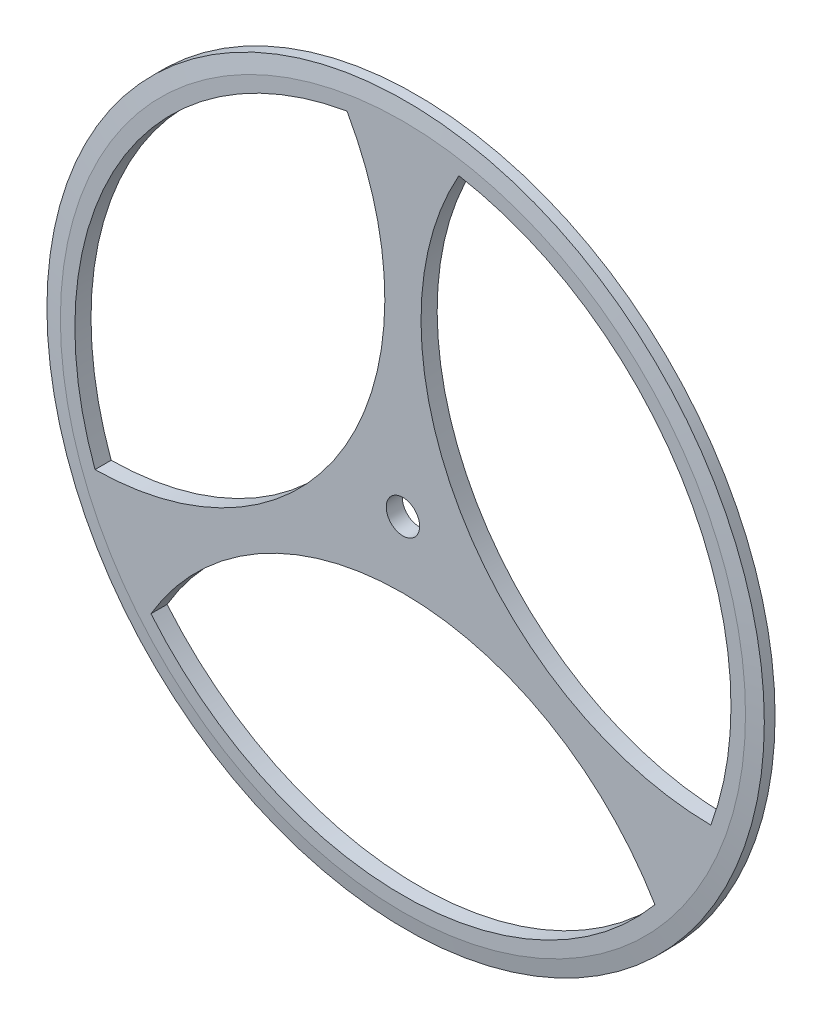
ISO-10303-21;
HEADER;
FILE_DESCRIPTION(('STEP AP214'),'2;1');
FILE_NAME('part.step','',(''),(''),'','','');
FILE_SCHEMA(('AUTOMOTIVE_DESIGN { 1 0 10303 214 1 1 1 1 }'));
ENDSEC;
DATA;
#1=APPLICATION_CONTEXT('core data for automotive mechanical design processes');
#2=APPLICATION_PROTOCOL_DEFINITION('international standard','automotive_design',2000,#1);
#3=PRODUCT_CONTEXT('',#1,'mechanical');
#4=PRODUCT('Part','Part','',(#3));
#5=PRODUCT_RELATED_PRODUCT_CATEGORY('part','',(#4));
#6=PRODUCT_DEFINITION_FORMATION('','',#4);
#7=PRODUCT_DEFINITION_CONTEXT('part definition',#1,'design');
#8=PRODUCT_DEFINITION('design','',#6,#7);
#9=PRODUCT_DEFINITION_SHAPE('','',#8);
#10=(LENGTH_UNIT() NAMED_UNIT(*) SI_UNIT(.MILLI.,.METRE.));
#11=(NAMED_UNIT(*) PLANE_ANGLE_UNIT() SI_UNIT($,.RADIAN.));
#12=(NAMED_UNIT(*) SI_UNIT($,.STERADIAN.) SOLID_ANGLE_UNIT());
#13=UNCERTAINTY_MEASURE_WITH_UNIT(LENGTH_MEASURE(1.E-05),#10,'distance_accuracy_value','');
#14=(GEOMETRIC_REPRESENTATION_CONTEXT(3) GLOBAL_UNCERTAINTY_ASSIGNED_CONTEXT((#13)) GLOBAL_UNIT_ASSIGNED_CONTEXT((#10,
#11,#12)) REPRESENTATION_CONTEXT('',''));
#15=CARTESIAN_POINT('',(0.,0.,0.));
#16=DIRECTION('',(0.,0.,1.));
#17=DIRECTION('',(1.,0.,0.));
#18=AXIS2_PLACEMENT_3D('',#15,#16,#17);
#19=CARTESIAN_POINT('',(0.,0.,0.15));
#20=DIRECTION('',(0.,0.,-1.));
#21=DIRECTION('',(-1.,0.,0.));
#22=AXIS2_PLACEMENT_3D('',#19,#20,#21);
#23=CYLINDRICAL_SURFACE('',#22,6.67);
#24=CARTESIAN_POINT('',(0.,0.,0.100000000000001));
#25=DIRECTION('',(0.,0.,1.));
#26=DIRECTION('',(1.,0.,0.));
#27=AXIS2_PLACEMENT_3D('',#24,#25,#26);
#28=CIRCLE('',#27,6.67);
#29=CARTESIAN_POINT('',(6.67,0.,0.100000000000001));
#30=VERTEX_POINT('',#29);
#31=EDGE_CURVE('E11',#30,#30,#28,.F.);
#32=ORIENTED_EDGE('',*,*,#31,.T.);
#33=EDGE_LOOP('',(#32));
#34=FACE_BOUND('',#33,.T.);
#35=CARTESIAN_POINT('',(0.,0.,-0.100000000000001));
#36=DIRECTION('',(0.,0.,1.));
#37=DIRECTION('',(1.,0.,0.));
#38=AXIS2_PLACEMENT_3D('',#35,#36,#37);
#39=CIRCLE('',#38,6.67);
#40=CARTESIAN_POINT('',(6.67,0.,-0.100000000000001));
#41=VERTEX_POINT('',#40);
#42=EDGE_CURVE('E145',#41,#41,#39,.T.);
#43=ORIENTED_EDGE('',*,*,#42,.T.);
#44=EDGE_LOOP('',(#43));
#45=FACE_BOUND('',#44,.T.);
#46=ADVANCED_FACE('F37',(#34,#45),#23,.T.);
#47=CARTESIAN_POINT('',(0.,0.,0.15));
#48=DIRECTION('',(0.,0.,1.));
#49=DIRECTION('',(1.,0.,0.));
#50=AXIS2_PLACEMENT_3D('',#47,#48,#49);
#51=PLANE('',#50);
#52=CARTESIAN_POINT('',(0.,0.,0.15));
#53=DIRECTION('',(0.,0.,1.));
#54=DIRECTION('',(-0.499999999999992,-0.866025403784443,0.));
#55=AXIS2_PLACEMENT_3D('',#52,#53,#54);
#56=CIRCLE('',#55,6.10000000000001);
#57=CARTESIAN_POINT('',(-4.68546660923413,-3.90594452773618,0.15));
#58=VERTEX_POINT('',#57);
#59=CARTESIAN_POINT('',(4.68546660923418,-3.90594452773611,0.15));
#60=VERTEX_POINT('',#59);
#61=EDGE_CURVE('E52',#58,#60,#56,.T.);
#62=ORIENTED_EDGE('',*,*,#61,.F.);
#63=CARTESIAN_POINT('',(0.,-6.67,0.15));
#64=DIRECTION('',(0.,0.,1.));
#65=DIRECTION('',(-0.499999999999992,-0.866025403784443,0.));
#66=AXIS2_PLACEMENT_3D('',#63,#64,#65);
#67=CIRCLE('',#66,5.44);
#68=EDGE_CURVE('E96',#60,#58,#67,.T.);
#69=ORIENTED_EDGE('',*,*,#68,.F.);
#70=EDGE_LOOP('',(#62,#69));
#71=FACE_BOUND('',#70,.T.);
#72=CARTESIAN_POINT('',(0.,0.,0.15));
#73=DIRECTION('',(0.,0.,1.));
#74=DIRECTION('',(-0.500000000000004,0.866025403784436,0.));
#75=AXIS2_PLACEMENT_3D('',#72,#73,#74);
#76=CIRCLE('',#75,6.10000000000001);
#77=CARTESIAN_POINT('',(-1.03991388217525,6.01070537604859,0.15));
#78=VERTEX_POINT('',#77);
#79=CARTESIAN_POINT('',(-5.72538049140939,-2.10476084831246,0.15));
#80=VERTEX_POINT('',#79);
#81=EDGE_CURVE('E92',#78,#80,#76,.T.);
#82=ORIENTED_EDGE('',*,*,#81,.F.);
#83=CARTESIAN_POINT('',(-5.77638944324221,3.33499999999999,0.15));
#84=DIRECTION('',(0.,0.,1.));
#85=DIRECTION('',(-0.500000000000004,0.866025403784436,0.));
#86=AXIS2_PLACEMENT_3D('',#83,#84,#85);
#87=CIRCLE('',#86,5.44);
#88=EDGE_CURVE('E109',#80,#78,#87,.T.);
#89=ORIENTED_EDGE('',*,*,#88,.F.);
#90=EDGE_LOOP('',(#82,#89));
#91=FACE_BOUND('',#90,.T.);
#92=CARTESIAN_POINT('',(0.,0.,0.15));
#93=DIRECTION('',(0.,0.,1.));
#94=DIRECTION('',(1.,0.,0.));
#95=AXIS2_PLACEMENT_3D('',#92,#93,#94);
#96=CIRCLE('',#95,6.10000000000001);
#97=CARTESIAN_POINT('',(5.72538049140938,-2.10476084831246,0.15));
#98=VERTEX_POINT('',#97);
#99=CARTESIAN_POINT('',(1.03991388217525,6.01070537604858,0.15));
#100=VERTEX_POINT('',#99);
#101=EDGE_CURVE('E121',#98,#100,#96,.T.);
#102=ORIENTED_EDGE('',*,*,#101,.F.);
#103=CARTESIAN_POINT('',(5.77638944324221,3.33499999999999,0.15));
#104=DIRECTION('',(0.,0.,1.));
#105=DIRECTION('',(1.,0.,0.));
#106=AXIS2_PLACEMENT_3D('',#103,#104,#105);
#107=CIRCLE('',#106,5.44);
#108=EDGE_CURVE('E125',#100,#98,#107,.T.);
#109=ORIENTED_EDGE('',*,*,#108,.F.);
#110=EDGE_LOOP('',(#102,#109));
#111=FACE_BOUND('',#110,.T.);
#112=CARTESIAN_POINT('',(0.,0.,0.15));
#113=DIRECTION('',(0.,0.,1.));
#114=DIRECTION('',(1.,0.,0.));
#115=AXIS2_PLACEMENT_3D('',#112,#113,#114);
#116=CIRCLE('',#115,0.3105);
#117=CARTESIAN_POINT('',(0.3105,0.,0.15));
#118=VERTEX_POINT('',#117);
#119=EDGE_CURVE('E137',#118,#118,#116,.T.);
#120=ORIENTED_EDGE('',*,*,#119,.F.);
#121=EDGE_LOOP('',(#120));
#122=FACE_BOUND('',#121,.T.);
#123=CARTESIAN_POINT('',(0.,0.,0.15));
#124=DIRECTION('',(0.,0.,1.));
#125=DIRECTION('',(1.,0.,0.));
#126=AXIS2_PLACEMENT_3D('',#123,#124,#125);
#127=CIRCLE('',#126,6.36999999999999);
#128=CARTESIAN_POINT('',(6.36999999999999,0.,0.15));
#129=VERTEX_POINT('',#128);
#130=EDGE_CURVE('E45',#129,#129,#127,.T.);
#131=ORIENTED_EDGE('',*,*,#130,.T.);
#132=EDGE_LOOP('',(#131));
#133=FACE_BOUND('',#132,.T.);
#134=ADVANCED_FACE('F100',(#71,#91,#111,#122,#133),#51,.T.);
#135=CARTESIAN_POINT('',(0.,0.,-0.15));
#136=DIRECTION('',(0.,0.,1.));
#137=DIRECTION('',(1.,0.,0.));
#138=AXIS2_PLACEMENT_3D('',#135,#136,#137);
#139=PLANE('',#138);
#140=CARTESIAN_POINT('',(0.,-6.67,-0.15));
#141=DIRECTION('',(0.,0.,1.));
#142=DIRECTION('',(-0.499999999999992,-0.866025403784443,0.));
#143=AXIS2_PLACEMENT_3D('',#140,#141,#142);
#144=CIRCLE('',#143,5.44);
#145=CARTESIAN_POINT('',(4.68546660923418,-3.90594452773611,-0.15));
#146=VERTEX_POINT('',#145);
#147=CARTESIAN_POINT('',(-4.68546660923413,-3.90594452773617,-0.15));
#148=VERTEX_POINT('',#147);
#149=EDGE_CURVE('E105',#146,#148,#144,.T.);
#150=ORIENTED_EDGE('',*,*,#149,.T.);
#151=CARTESIAN_POINT('',(0.,0.,-0.15));
#152=DIRECTION('',(0.,0.,1.));
#153=DIRECTION('',(-0.499999999999992,-0.866025403784443,0.));
#154=AXIS2_PLACEMENT_3D('',#151,#152,#153);
#155=CIRCLE('',#154,6.10000000000001);
#156=EDGE_CURVE('E57',#148,#146,#155,.T.);
#157=ORIENTED_EDGE('',*,*,#156,.T.);
#158=EDGE_LOOP('',(#150,#157));
#159=FACE_BOUND('',#158,.T.);
#160=CARTESIAN_POINT('',(-5.77638944324221,3.33499999999999,-0.15));
#161=DIRECTION('',(0.,0.,1.));
#162=DIRECTION('',(-0.500000000000004,0.866025403784436,0.));
#163=AXIS2_PLACEMENT_3D('',#160,#161,#162);
#164=CIRCLE('',#163,5.44);
#165=CARTESIAN_POINT('',(-5.72538049140939,-2.10476084831246,-0.15));
#166=VERTEX_POINT('',#165);
#167=CARTESIAN_POINT('',(-1.03991388217525,6.01070537604859,-0.15));
#168=VERTEX_POINT('',#167);
#169=EDGE_CURVE('E115',#166,#168,#164,.T.);
#170=ORIENTED_EDGE('',*,*,#169,.T.);
#171=CARTESIAN_POINT('',(0.,0.,-0.15));
#172=DIRECTION('',(0.,0.,1.));
#173=DIRECTION('',(-0.500000000000004,0.866025403784436,0.));
#174=AXIS2_PLACEMENT_3D('',#171,#172,#173);
#175=CIRCLE('',#174,6.10000000000001);
#176=EDGE_CURVE('E112',#168,#166,#175,.T.);
#177=ORIENTED_EDGE('',*,*,#176,.T.);
#178=EDGE_LOOP('',(#170,#177));
#179=FACE_BOUND('',#178,.T.);
#180=CARTESIAN_POINT('',(5.77638944324221,3.33499999999999,-0.15));
#181=DIRECTION('',(0.,0.,1.));
#182=DIRECTION('',(1.,0.,0.));
#183=AXIS2_PLACEMENT_3D('',#180,#181,#182);
#184=CIRCLE('',#183,5.44);
#185=CARTESIAN_POINT('',(1.03991388217525,6.01070537604858,-0.15));
#186=VERTEX_POINT('',#185);
#187=CARTESIAN_POINT('',(5.72538049140938,-2.10476084831246,-0.15));
#188=VERTEX_POINT('',#187);
#189=EDGE_CURVE('E131',#186,#188,#184,.T.);
#190=ORIENTED_EDGE('',*,*,#189,.T.);
#191=CARTESIAN_POINT('',(0.,0.,-0.15));
#192=DIRECTION('',(0.,0.,1.));
#193=DIRECTION('',(1.,0.,0.));
#194=AXIS2_PLACEMENT_3D('',#191,#192,#193);
#195=CIRCLE('',#194,6.10000000000001);
#196=EDGE_CURVE('E128',#188,#186,#195,.T.);
#197=ORIENTED_EDGE('',*,*,#196,.T.);
#198=EDGE_LOOP('',(#190,#197));
#199=FACE_BOUND('',#198,.T.);
#200=CARTESIAN_POINT('',(0.,0.,-0.15));
#201=DIRECTION('',(0.,0.,1.));
#202=DIRECTION('',(1.,0.,0.));
#203=AXIS2_PLACEMENT_3D('',#200,#201,#202);
#204=CIRCLE('',#203,0.3105);
#205=CARTESIAN_POINT('',(0.3105,0.,-0.15));
#206=VERTEX_POINT('',#205);
#207=EDGE_CURVE('E142',#206,#206,#204,.T.);
#208=ORIENTED_EDGE('',*,*,#207,.T.);
#209=EDGE_LOOP('',(#208));
#210=FACE_BOUND('',#209,.T.);
#211=CARTESIAN_POINT('',(0.,0.,-0.15));
#212=DIRECTION('',(0.,0.,1.));
#213=DIRECTION('',(1.,0.,0.));
#214=AXIS2_PLACEMENT_3D('',#211,#212,#213);
#215=CIRCLE('',#214,6.37);
#216=CARTESIAN_POINT('',(6.37,0.,-0.15));
#217=VERTEX_POINT('',#216);
#218=EDGE_CURVE('E148',#217,#217,#215,.F.);
#219=ORIENTED_EDGE('',*,*,#218,.T.);
#220=EDGE_LOOP('',(#219));
#221=FACE_BOUND('',#220,.T.);
#222=ADVANCED_FACE('F165',(#159,#179,#199,#210,#221),#139,.F.);
#223=CARTESIAN_POINT('',(0.,0.,-0.100000000000001));
#224=DIRECTION('',(0.,0.,1.));
#225=DIRECTION('',(1.,0.,0.));
#226=AXIS2_PLACEMENT_3D('',#223,#224,#225);
#227=CONICAL_SURFACE('',#226,6.67,1.40564764938027);
#228=ORIENTED_EDGE('',*,*,#218,.F.);
#229=EDGE_LOOP('',(#228));
#230=FACE_BOUND('',#229,.T.);
#231=ORIENTED_EDGE('',*,*,#42,.F.);
#232=EDGE_LOOP('',(#231));
#233=FACE_BOUND('',#232,.T.);
#234=ADVANCED_FACE('F156',(#230,#233),#227,.T.);
#235=CARTESIAN_POINT('',(0.,0.,0.15));
#236=DIRECTION('',(0.,0.,-1.));
#237=DIRECTION('',(-1.,0.,0.));
#238=AXIS2_PLACEMENT_3D('',#235,#236,#237);
#239=CONICAL_SURFACE('',#238,6.36999999999999,1.40564764938027);
#240=ORIENTED_EDGE('',*,*,#31,.F.);
#241=EDGE_LOOP('',(#240));
#242=FACE_BOUND('',#241,.T.);
#243=ORIENTED_EDGE('',*,*,#130,.F.);
#244=EDGE_LOOP('',(#243));
#245=FACE_BOUND('',#244,.T.);
#246=ADVANCED_FACE('F39',(#242,#245),#239,.T.);
#247=CARTESIAN_POINT('',(0.,0.,-0.15));
#248=DIRECTION('',(0.,0.,1.));
#249=DIRECTION('',(1.,0.,0.));
#250=AXIS2_PLACEMENT_3D('',#247,#248,#249);
#251=CYLINDRICAL_SURFACE('',#250,0.3105);
#252=ORIENTED_EDGE('',*,*,#207,.F.);
#253=EDGE_LOOP('',(#252));
#254=FACE_BOUND('',#253,.T.);
#255=ORIENTED_EDGE('',*,*,#119,.T.);
#256=EDGE_LOOP('',(#255));
#257=FACE_BOUND('',#256,.T.);
#258=ADVANCED_FACE('F155',(#254,#257),#251,.F.);
#259=CARTESIAN_POINT('',(0.,0.,-0.15));
#260=DIRECTION('',(0.,0.,1.));
#261=DIRECTION('',(1.,0.,0.));
#262=AXIS2_PLACEMENT_3D('',#259,#260,#261);
#263=CYLINDRICAL_SURFACE('',#262,6.10000000000001);
#264=DIRECTION('',(0.,0.,1.));
#265=VECTOR('',#264,1.);
#266=CARTESIAN_POINT('',(1.03991388217525,6.01070537604858,-0.15));
#267=LINE('',#266,#265);
#268=EDGE_CURVE('E134',#186,#100,#267,.T.);
#269=ORIENTED_EDGE('',*,*,#268,.F.);
#270=ORIENTED_EDGE('',*,*,#196,.F.);
#271=DIRECTION('',(0.,0.,1.));
#272=VECTOR('',#271,1.);
#273=CARTESIAN_POINT('',(5.72538049140938,-2.10476084831246,-0.15));
#274=LINE('',#273,#272);
#275=EDGE_CURVE('E135',#188,#98,#274,.T.);
#276=ORIENTED_EDGE('',*,*,#275,.T.);
#277=ORIENTED_EDGE('',*,*,#101,.T.);
#278=EDGE_LOOP('',(#269,#270,#276,#277));
#279=FACE_BOUND('',#278,.T.);
#280=ADVANCED_FACE('F162',(#279),#263,.F.);
#281=CARTESIAN_POINT('',(5.77638944324221,3.33499999999999,-0.15));
#282=DIRECTION('',(0.,0.,1.));
#283=DIRECTION('',(1.,0.,0.));
#284=AXIS2_PLACEMENT_3D('',#281,#282,#283);
#285=CYLINDRICAL_SURFACE('',#284,5.44);
#286=ORIENTED_EDGE('',*,*,#275,.F.);
#287=ORIENTED_EDGE('',*,*,#189,.F.);
#288=ORIENTED_EDGE('',*,*,#268,.T.);
#289=ORIENTED_EDGE('',*,*,#108,.T.);
#290=EDGE_LOOP('',(#286,#287,#288,#289));
#291=FACE_BOUND('',#290,.T.);
#292=ADVANCED_FACE('F182',(#291),#285,.F.);
#293=CARTESIAN_POINT('',(0.,0.,-0.15));
#294=DIRECTION('',(0.,0.,1.));
#295=DIRECTION('',(1.,0.,0.));
#296=AXIS2_PLACEMENT_3D('',#293,#294,#295);
#297=CYLINDRICAL_SURFACE('',#296,6.10000000000001);
#298=DIRECTION('',(0.,0.,1.));
#299=VECTOR('',#298,1.);
#300=CARTESIAN_POINT('',(-5.72538049140939,-2.10476084831246,-0.15));
#301=LINE('',#300,#299);
#302=EDGE_CURVE('E118',#166,#80,#301,.T.);
#303=ORIENTED_EDGE('',*,*,#302,.F.);
#304=ORIENTED_EDGE('',*,*,#176,.F.);
#305=DIRECTION('',(0.,0.,1.));
#306=VECTOR('',#305,1.);
#307=CARTESIAN_POINT('',(-1.03991388217525,6.01070537604859,-0.15));
#308=LINE('',#307,#306);
#309=EDGE_CURVE('E119',#168,#78,#308,.T.);
#310=ORIENTED_EDGE('',*,*,#309,.T.);
#311=ORIENTED_EDGE('',*,*,#81,.T.);
#312=EDGE_LOOP('',(#303,#304,#310,#311));
#313=FACE_BOUND('',#312,.T.);
#314=ADVANCED_FACE('F186',(#313),#297,.F.);
#315=CARTESIAN_POINT('',(-5.77638944324221,3.33499999999999,-0.15));
#316=DIRECTION('',(0.,0.,1.));
#317=DIRECTION('',(1.,0.,0.));
#318=AXIS2_PLACEMENT_3D('',#315,#316,#317);
#319=CYLINDRICAL_SURFACE('',#318,5.44);
#320=ORIENTED_EDGE('',*,*,#309,.F.);
#321=ORIENTED_EDGE('',*,*,#169,.F.);
#322=ORIENTED_EDGE('',*,*,#302,.T.);
#323=ORIENTED_EDGE('',*,*,#88,.T.);
#324=EDGE_LOOP('',(#320,#321,#322,#323));
#325=FACE_BOUND('',#324,.T.);
#326=ADVANCED_FACE('F190',(#325),#319,.F.);
#327=CARTESIAN_POINT('',(0.,0.,-0.15));
#328=DIRECTION('',(0.,0.,1.));
#329=DIRECTION('',(1.,0.,0.));
#330=AXIS2_PLACEMENT_3D('',#327,#328,#329);
#331=CYLINDRICAL_SURFACE('',#330,6.10000000000001);
#332=DIRECTION('',(0.,0.,1.));
#333=VECTOR('',#332,1.);
#334=CARTESIAN_POINT('',(4.68546660923418,-3.90594452773611,-0.15));
#335=LINE('',#334,#333);
#336=EDGE_CURVE('E93',#146,#60,#335,.T.);
#337=ORIENTED_EDGE('',*,*,#336,.F.);
#338=ORIENTED_EDGE('',*,*,#156,.F.);
#339=DIRECTION('',(0.,0.,1.));
#340=VECTOR('',#339,1.);
#341=CARTESIAN_POINT('',(-4.68546660923413,-3.90594452773618,-0.15));
#342=LINE('',#341,#340);
#343=EDGE_CURVE('E86',#148,#58,#342,.T.);
#344=ORIENTED_EDGE('',*,*,#343,.T.);
#345=ORIENTED_EDGE('',*,*,#61,.T.);
#346=EDGE_LOOP('',(#337,#338,#344,#345));
#347=FACE_BOUND('',#346,.T.);
#348=ADVANCED_FACE('F88',(#347),#331,.F.);
#349=CARTESIAN_POINT('',(0.,-6.67,-0.15));
#350=DIRECTION('',(0.,0.,1.));
#351=DIRECTION('',(1.,0.,0.));
#352=AXIS2_PLACEMENT_3D('',#349,#350,#351);
#353=CYLINDRICAL_SURFACE('',#352,5.44);
#354=ORIENTED_EDGE('',*,*,#343,.F.);
#355=ORIENTED_EDGE('',*,*,#149,.F.);
#356=ORIENTED_EDGE('',*,*,#336,.T.);
#357=ORIENTED_EDGE('',*,*,#68,.T.);
#358=EDGE_LOOP('',(#354,#355,#356,#357));
#359=FACE_BOUND('',#358,.T.);
#360=ADVANCED_FACE('F97',(#359),#353,.F.);
#361=CLOSED_SHELL('',(#46,#134,#222,#234,#246,#258,#280,#292,#314,#326,#348,#360));
#362=MANIFOLD_SOLID_BREP('B2',#361);
#363=ADVANCED_BREP_SHAPE_REPRESENTATION('',(#18,#362),#14);
#364=SHAPE_DEFINITION_REPRESENTATION(#9,#363);
ENDSEC;
END-ISO-10303-21;
